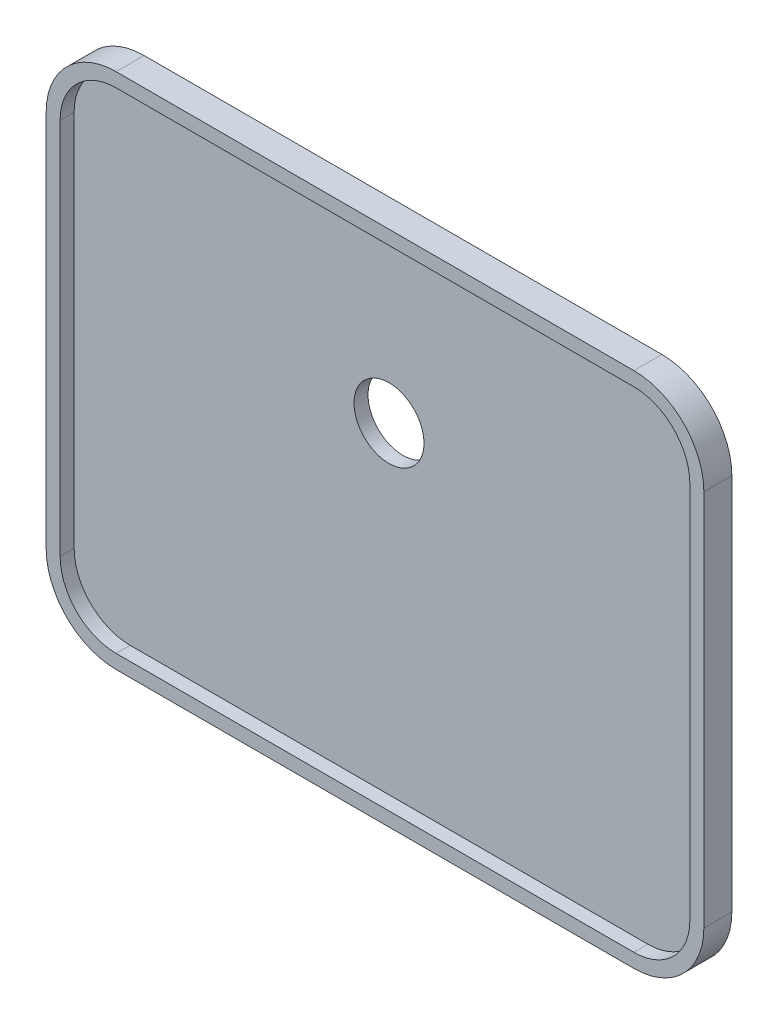
ISO-10303-21;
HEADER;
FILE_DESCRIPTION(('STEP AP214'),'2;1');
FILE_NAME('part.step','',(''),(''),'','','');
FILE_SCHEMA(('AUTOMOTIVE_DESIGN { 1 0 10303 214 1 1 1 1 }'));
ENDSEC;
DATA;
#1=APPLICATION_CONTEXT('core data for automotive mechanical design processes');
#2=APPLICATION_PROTOCOL_DEFINITION('international standard','automotive_design',2000,#1);
#3=PRODUCT_CONTEXT('',#1,'mechanical');
#4=PRODUCT('Part','Part','',(#3));
#5=PRODUCT_RELATED_PRODUCT_CATEGORY('part','',(#4));
#6=PRODUCT_DEFINITION_FORMATION('','',#4);
#7=PRODUCT_DEFINITION_CONTEXT('part definition',#1,'design');
#8=PRODUCT_DEFINITION('design','',#6,#7);
#9=PRODUCT_DEFINITION_SHAPE('','',#8);
#10=(LENGTH_UNIT() NAMED_UNIT(*) SI_UNIT(.MILLI.,.METRE.));
#11=(NAMED_UNIT(*) PLANE_ANGLE_UNIT() SI_UNIT($,.RADIAN.));
#12=(NAMED_UNIT(*) SI_UNIT($,.STERADIAN.) SOLID_ANGLE_UNIT());
#13=UNCERTAINTY_MEASURE_WITH_UNIT(LENGTH_MEASURE(1.E-05),#10,'distance_accuracy_value','');
#14=(GEOMETRIC_REPRESENTATION_CONTEXT(3) GLOBAL_UNCERTAINTY_ASSIGNED_CONTEXT((#13)) GLOBAL_UNIT_ASSIGNED_CONTEXT((#10,
#11,#12)) REPRESENTATION_CONTEXT('',''));
#15=CARTESIAN_POINT('',(0.,0.,0.));
#16=DIRECTION('',(0.,0.,1.));
#17=DIRECTION('',(1.,0.,0.));
#18=AXIS2_PLACEMENT_3D('',#15,#16,#17);
#19=CARTESIAN_POINT('',(-0.33033494899213,45.0936002495328,0.));
#20=DIRECTION('',(0.,0.,-1.));
#21=DIRECTION('',(-1.,0.,0.));
#22=AXIS2_PLACEMENT_3D('',#19,#20,#21);
#23=PLANE('',#22);
#24=CARTESIAN_POINT('',(-0.33033494899213,45.0936002495328,0.));
#25=DIRECTION('',(0.,0.,1.));
#26=DIRECTION('',(-1.,0.,0.));
#27=AXIS2_PLACEMENT_3D('',#24,#25,#26);
#28=CIRCLE('',#27,50.);
#29=CARTESIAN_POINT('',(-0.33033494899213,95.0936002495329,0.));
#30=VERTEX_POINT('',#29);
#31=CARTESIAN_POINT('',(-50.3303349489921,45.0936002495328,0.));
#32=VERTEX_POINT('',#31);
#33=EDGE_CURVE('E206',#30,#32,#28,.T.);
#34=ORIENTED_EDGE('',*,*,#33,.F.);
#35=DIRECTION('',(-1.,0.,0.));
#36=VECTOR('',#35,1.);
#37=CARTESIAN_POINT('',(-0.33033494899213,95.0936002495329,0.));
#38=LINE('',#37,#36);
#39=CARTESIAN_POINT('',(369.669665051008,95.0936002495329,0.));
#40=VERTEX_POINT('',#39);
#41=EDGE_CURVE('E211',#40,#30,#38,.T.);
#42=ORIENTED_EDGE('',*,*,#41,.F.);
#43=CARTESIAN_POINT('',(369.669665051008,45.0936002495329,0.));
#44=DIRECTION('',(0.,0.,1.));
#45=DIRECTION('',(1.,0.,0.));
#46=AXIS2_PLACEMENT_3D('',#43,#44,#45);
#47=CIRCLE('',#46,50.);
#48=CARTESIAN_POINT('',(419.669665051008,45.0936002495329,0.));
#49=VERTEX_POINT('',#48);
#50=EDGE_CURVE('E238',#49,#40,#47,.T.);
#51=ORIENTED_EDGE('',*,*,#50,.F.);
#52=DIRECTION('',(0.,1.,0.));
#53=VECTOR('',#52,1.);
#54=CARTESIAN_POINT('',(419.669665051008,45.0936002495329,0.));
#55=LINE('',#54,#53);
#56=CARTESIAN_POINT('',(419.669665051008,-224.906399750467,0.));
#57=VERTEX_POINT('',#56);
#58=EDGE_CURVE('E236',#57,#49,#55,.T.);
#59=ORIENTED_EDGE('',*,*,#58,.F.);
#60=CARTESIAN_POINT('',(369.669665051008,-224.906399750467,0.));
#61=DIRECTION('',(0.,0.,1.));
#62=DIRECTION('',(1.,0.,0.));
#63=AXIS2_PLACEMENT_3D('',#60,#61,#62);
#64=CIRCLE('',#63,50.);
#65=CARTESIAN_POINT('',(369.669665051008,-274.906399750467,0.));
#66=VERTEX_POINT('',#65);
#67=EDGE_CURVE('E234',#66,#57,#64,.T.);
#68=ORIENTED_EDGE('',*,*,#67,.F.);
#69=DIRECTION('',(1.,0.,0.));
#70=VECTOR('',#69,1.);
#71=CARTESIAN_POINT('',(-0.330334948992123,-274.906399750467,0.));
#72=LINE('',#71,#70);
#73=CARTESIAN_POINT('',(-0.330334948992123,-274.906399750467,0.));
#74=VERTEX_POINT('',#73);
#75=EDGE_CURVE('E232',#74,#66,#72,.T.);
#76=ORIENTED_EDGE('',*,*,#75,.F.);
#77=CARTESIAN_POINT('',(-0.330334948992123,-224.906399750467,0.));
#78=DIRECTION('',(0.,0.,1.));
#79=DIRECTION('',(1.,0.,0.));
#80=AXIS2_PLACEMENT_3D('',#77,#78,#79);
#81=CIRCLE('',#80,50.);
#82=CARTESIAN_POINT('',(-50.3303349489921,-224.906399750467,0.));
#83=VERTEX_POINT('',#82);
#84=EDGE_CURVE('E230',#83,#74,#81,.T.);
#85=ORIENTED_EDGE('',*,*,#84,.F.);
#86=DIRECTION('',(0.,-1.,0.));
#87=VECTOR('',#86,1.);
#88=CARTESIAN_POINT('',(-50.3303349489921,45.0936002495328,0.));
#89=LINE('',#88,#87);
#90=EDGE_CURVE('E228',#32,#83,#89,.T.);
#91=ORIENTED_EDGE('',*,*,#90,.F.);
#92=EDGE_LOOP('',(#34,#42,#51,#59,#68,#76,#85,#91));
#93=FACE_BOUND('',#92,.T.);
#94=CARTESIAN_POINT('',(184.669665051008,-34.9063997504672,0.));
#95=DIRECTION('',(0.,0.,1.));
#96=DIRECTION('',(1.,0.,0.));
#97=AXIS2_PLACEMENT_3D('',#94,#95,#96);
#98=CIRCLE('',#97,25.);
#99=CARTESIAN_POINT('',(209.669665051008,-34.9063997504672,0.));
#100=VERTEX_POINT('',#99);
#101=EDGE_CURVE('E359',#100,#100,#98,.T.);
#102=ORIENTED_EDGE('',*,*,#101,.T.);
#103=EDGE_LOOP('',(#102));
#104=FACE_BOUND('',#103,.T.);
#105=ADVANCED_FACE('F31',(#93,#104),#23,.T.);
#106=CARTESIAN_POINT('',(-0.330334948992123,-224.906399750467,10.));
#107=DIRECTION('',(0.,0.,1.));
#108=DIRECTION('',(1.,0.,0.));
#109=AXIS2_PLACEMENT_3D('',#106,#107,#108);
#110=PLANE('',#109);
#111=CARTESIAN_POINT('',(-0.330334948992123,-224.906399750467,10.));
#112=DIRECTION('',(0.,0.,1.));
#113=DIRECTION('',(1.,0.,0.));
#114=AXIS2_PLACEMENT_3D('',#111,#112,#113);
#115=CIRCLE('',#114,40.);
#116=CARTESIAN_POINT('',(-40.3303349489921,-224.906399750467,10.));
#117=VERTEX_POINT('',#116);
#118=CARTESIAN_POINT('',(-0.330334948992123,-264.906399750467,10.));
#119=VERTEX_POINT('',#118);
#120=EDGE_CURVE('E160',#117,#119,#115,.T.);
#121=ORIENTED_EDGE('',*,*,#120,.T.);
#122=DIRECTION('',(1.,0.,0.));
#123=VECTOR('',#122,1.);
#124=CARTESIAN_POINT('',(-0.330334948991838,-264.906399750467,10.));
#125=LINE('',#124,#123);
#126=CARTESIAN_POINT('',(369.669665051008,-264.906399750467,10.));
#127=VERTEX_POINT('',#126);
#128=EDGE_CURVE('E47',#119,#127,#125,.T.);
#129=ORIENTED_EDGE('',*,*,#128,.T.);
#130=CARTESIAN_POINT('',(369.669665051008,-224.906399750467,10.));
#131=DIRECTION('',(0.,0.,1.));
#132=DIRECTION('',(-1.,0.,0.));
#133=AXIS2_PLACEMENT_3D('',#130,#131,#132);
#134=CIRCLE('',#133,40.);
#135=CARTESIAN_POINT('',(409.669665051008,-224.906399750467,10.));
#136=VERTEX_POINT('',#135);
#137=EDGE_CURVE('E55',#127,#136,#134,.T.);
#138=ORIENTED_EDGE('',*,*,#137,.T.);
#139=DIRECTION('',(0.,1.,0.));
#140=VECTOR('',#139,1.);
#141=CARTESIAN_POINT('',(409.669665051008,-224.906399750467,10.));
#142=LINE('',#141,#140);
#143=CARTESIAN_POINT('',(409.669665051008,45.0936002495329,10.));
#144=VERTEX_POINT('',#143);
#145=EDGE_CURVE('E364',#136,#144,#142,.T.);
#146=ORIENTED_EDGE('',*,*,#145,.T.);
#147=CARTESIAN_POINT('',(369.669665051008,45.0936002495329,10.));
#148=DIRECTION('',(0.,0.,1.));
#149=DIRECTION('',(1.,0.,0.));
#150=AXIS2_PLACEMENT_3D('',#147,#148,#149);
#151=CIRCLE('',#150,40.);
#152=CARTESIAN_POINT('',(369.669665051008,85.0936002495329,10.));
#153=VERTEX_POINT('',#152);
#154=EDGE_CURVE('E367',#144,#153,#151,.T.);
#155=ORIENTED_EDGE('',*,*,#154,.T.);
#156=DIRECTION('',(-1.,0.,0.));
#157=VECTOR('',#156,1.);
#158=CARTESIAN_POINT('',(-0.330334948991845,85.0936002495329,10.));
#159=LINE('',#158,#157);
#160=CARTESIAN_POINT('',(-0.330334948992132,85.0936002495329,10.));
#161=VERTEX_POINT('',#160);
#162=EDGE_CURVE('E174',#153,#161,#159,.T.);
#163=ORIENTED_EDGE('',*,*,#162,.T.);
#164=CARTESIAN_POINT('',(-0.330334948992123,45.0936002495328,10.));
#165=DIRECTION('',(0.,0.,1.));
#166=DIRECTION('',(1.,0.,0.));
#167=AXIS2_PLACEMENT_3D('',#164,#165,#166);
#168=CIRCLE('',#167,40.);
#169=CARTESIAN_POINT('',(-40.3303349489921,45.0936002495328,10.));
#170=VERTEX_POINT('',#169);
#171=EDGE_CURVE('E169',#161,#170,#168,.T.);
#172=ORIENTED_EDGE('',*,*,#171,.T.);
#173=DIRECTION('',(0.,-1.,0.));
#174=VECTOR('',#173,1.);
#175=CARTESIAN_POINT('',(-40.3303349489921,-224.906399750467,10.));
#176=LINE('',#175,#174);
#177=EDGE_CURVE('E151',#170,#117,#176,.T.);
#178=ORIENTED_EDGE('',*,*,#177,.T.);
#179=EDGE_LOOP('',(#121,#129,#138,#146,#155,#163,#172,#178));
#180=FACE_BOUND('',#179,.T.);
#181=CARTESIAN_POINT('',(184.669665051008,-34.9063997504672,10.));
#182=DIRECTION('',(0.,0.,1.));
#183=DIRECTION('',(1.,0.,0.));
#184=AXIS2_PLACEMENT_3D('',#181,#182,#183);
#185=CIRCLE('',#184,25.);
#186=CARTESIAN_POINT('',(209.669665051008,-34.9063997504672,10.));
#187=VERTEX_POINT('',#186);
#188=EDGE_CURVE('E35',#187,#187,#185,.F.);
#189=ORIENTED_EDGE('',*,*,#188,.T.);
#190=EDGE_LOOP('',(#189));
#191=FACE_BOUND('',#190,.T.);
#192=ADVANCED_FACE('F166',(#180,#191),#110,.T.);
#193=CARTESIAN_POINT('',(-0.33033494899213,45.0936002495328,20.));
#194=DIRECTION('',(0.,0.,-1.));
#195=DIRECTION('',(-1.,0.,0.));
#196=AXIS2_PLACEMENT_3D('',#193,#194,#195);
#197=PLANE('',#196);
#198=CARTESIAN_POINT('',(-0.33033494899213,45.0936002495328,20.));
#199=DIRECTION('',(0.,0.,1.));
#200=DIRECTION('',(-1.,0.,0.));
#201=AXIS2_PLACEMENT_3D('',#198,#199,#200);
#202=CIRCLE('',#201,50.);
#203=CARTESIAN_POINT('',(-0.33033494899213,95.0936002495329,20.));
#204=VERTEX_POINT('',#203);
#205=CARTESIAN_POINT('',(-50.3303349489921,45.0936002495328,20.));
#206=VERTEX_POINT('',#205);
#207=EDGE_CURVE('E207',#204,#206,#202,.T.);
#208=ORIENTED_EDGE('',*,*,#207,.T.);
#209=DIRECTION('',(0.,-1.,0.));
#210=VECTOR('',#209,1.);
#211=CARTESIAN_POINT('',(-50.3303349489921,45.0936002495328,20.));
#212=LINE('',#211,#210);
#213=CARTESIAN_POINT('',(-50.3303349489921,-224.906399750467,20.));
#214=VERTEX_POINT('',#213);
#215=EDGE_CURVE('E210',#206,#214,#212,.T.);
#216=ORIENTED_EDGE('',*,*,#215,.T.);
#217=CARTESIAN_POINT('',(-0.330334948992123,-224.906399750467,20.));
#218=DIRECTION('',(0.,0.,1.));
#219=DIRECTION('',(1.,0.,0.));
#220=AXIS2_PLACEMENT_3D('',#217,#218,#219);
#221=CIRCLE('',#220,50.);
#222=CARTESIAN_POINT('',(-0.330334948992123,-274.906399750467,20.));
#223=VERTEX_POINT('',#222);
#224=EDGE_CURVE('E213',#214,#223,#221,.T.);
#225=ORIENTED_EDGE('',*,*,#224,.T.);
#226=DIRECTION('',(1.,0.,0.));
#227=VECTOR('',#226,1.);
#228=CARTESIAN_POINT('',(-0.330334948992123,-274.906399750467,20.));
#229=LINE('',#228,#227);
#230=CARTESIAN_POINT('',(369.669665051008,-274.906399750467,20.));
#231=VERTEX_POINT('',#230);
#232=EDGE_CURVE('E215',#223,#231,#229,.T.);
#233=ORIENTED_EDGE('',*,*,#232,.T.);
#234=CARTESIAN_POINT('',(369.669665051008,-224.906399750467,20.));
#235=DIRECTION('',(0.,0.,1.));
#236=DIRECTION('',(1.,0.,0.));
#237=AXIS2_PLACEMENT_3D('',#234,#235,#236);
#238=CIRCLE('',#237,50.);
#239=CARTESIAN_POINT('',(419.669665051008,-224.906399750467,20.));
#240=VERTEX_POINT('',#239);
#241=EDGE_CURVE('E217',#231,#240,#238,.T.);
#242=ORIENTED_EDGE('',*,*,#241,.T.);
#243=DIRECTION('',(0.,1.,0.));
#244=VECTOR('',#243,1.);
#245=CARTESIAN_POINT('',(419.669665051008,45.0936002495329,20.));
#246=LINE('',#245,#244);
#247=CARTESIAN_POINT('',(419.669665051008,45.0936002495329,20.));
#248=VERTEX_POINT('',#247);
#249=EDGE_CURVE('E219',#240,#248,#246,.T.);
#250=ORIENTED_EDGE('',*,*,#249,.T.);
#251=CARTESIAN_POINT('',(369.669665051008,45.0936002495329,20.));
#252=DIRECTION('',(0.,0.,1.));
#253=DIRECTION('',(1.,0.,0.));
#254=AXIS2_PLACEMENT_3D('',#251,#252,#253);
#255=CIRCLE('',#254,50.);
#256=CARTESIAN_POINT('',(369.669665051008,95.0936002495329,20.));
#257=VERTEX_POINT('',#256);
#258=EDGE_CURVE('E221',#248,#257,#255,.T.);
#259=ORIENTED_EDGE('',*,*,#258,.T.);
#260=DIRECTION('',(-1.,0.,0.));
#261=VECTOR('',#260,1.);
#262=CARTESIAN_POINT('',(-0.33033494899213,95.0936002495329,20.));
#263=LINE('',#262,#261);
#264=EDGE_CURVE('E223',#257,#204,#263,.T.);
#265=ORIENTED_EDGE('',*,*,#264,.T.);
#266=EDGE_LOOP('',(#208,#216,#225,#233,#242,#250,#259,#265));
#267=FACE_BOUND('',#266,.T.);
#268=CARTESIAN_POINT('',(-0.330334948992123,-224.906399750467,20.));
#269=DIRECTION('',(0.,0.,1.));
#270=DIRECTION('',(1.,0.,0.));
#271=AXIS2_PLACEMENT_3D('',#268,#269,#270);
#272=CIRCLE('',#271,40.);
#273=CARTESIAN_POINT('',(-40.3303349489921,-224.906399750467,20.));
#274=VERTEX_POINT('',#273);
#275=CARTESIAN_POINT('',(-0.330334948992123,-264.906399750467,20.));
#276=VERTEX_POINT('',#275);
#277=EDGE_CURVE('E170',#274,#276,#272,.T.);
#278=ORIENTED_EDGE('',*,*,#277,.F.);
#279=DIRECTION('',(0.,-1.,0.));
#280=VECTOR('',#279,1.);
#281=CARTESIAN_POINT('',(-40.3303349489921,45.0936002495328,20.));
#282=LINE('',#281,#280);
#283=CARTESIAN_POINT('',(-40.3303349489921,45.0936002495328,20.));
#284=VERTEX_POINT('',#283);
#285=EDGE_CURVE('E154',#284,#274,#282,.T.);
#286=ORIENTED_EDGE('',*,*,#285,.F.);
#287=CARTESIAN_POINT('',(-0.33033494899213,45.0936002495328,20.));
#288=DIRECTION('',(0.,0.,1.));
#289=DIRECTION('',(-1.,0.,0.));
#290=AXIS2_PLACEMENT_3D('',#287,#288,#289);
#291=CIRCLE('',#290,40.);
#292=CARTESIAN_POINT('',(-0.330334948992132,85.0936002495329,20.));
#293=VERTEX_POINT('',#292);
#294=EDGE_CURVE('E187',#293,#284,#291,.T.);
#295=ORIENTED_EDGE('',*,*,#294,.F.);
#296=DIRECTION('',(-1.,0.,0.));
#297=VECTOR('',#296,1.);
#298=CARTESIAN_POINT('',(-0.33033494899213,85.0936002495329,20.));
#299=LINE('',#298,#297);
#300=CARTESIAN_POINT('',(369.669665051008,85.0936002495329,20.));
#301=VERTEX_POINT('',#300);
#302=EDGE_CURVE('E185',#301,#293,#299,.T.);
#303=ORIENTED_EDGE('',*,*,#302,.F.);
#304=CARTESIAN_POINT('',(369.669665051008,45.0936002495329,20.));
#305=DIRECTION('',(0.,0.,1.));
#306=DIRECTION('',(1.,0.,0.));
#307=AXIS2_PLACEMENT_3D('',#304,#305,#306);
#308=CIRCLE('',#307,40.);
#309=CARTESIAN_POINT('',(409.669665051008,45.0936002495329,20.));
#310=VERTEX_POINT('',#309);
#311=EDGE_CURVE('E183',#310,#301,#308,.T.);
#312=ORIENTED_EDGE('',*,*,#311,.F.);
#313=DIRECTION('',(0.,1.,0.));
#314=VECTOR('',#313,1.);
#315=CARTESIAN_POINT('',(409.669665051008,45.0936002495329,20.));
#316=LINE('',#315,#314);
#317=CARTESIAN_POINT('',(409.669665051008,-224.906399750467,20.));
#318=VERTEX_POINT('',#317);
#319=EDGE_CURVE('E181',#318,#310,#316,.T.);
#320=ORIENTED_EDGE('',*,*,#319,.F.);
#321=CARTESIAN_POINT('',(369.669665051008,-224.906399750467,20.));
#322=DIRECTION('',(0.,0.,1.));
#323=DIRECTION('',(1.,0.,0.));
#324=AXIS2_PLACEMENT_3D('',#321,#322,#323);
#325=CIRCLE('',#324,40.);
#326=CARTESIAN_POINT('',(369.669665051008,-264.906399750467,20.));
#327=VERTEX_POINT('',#326);
#328=EDGE_CURVE('E179',#327,#318,#325,.T.);
#329=ORIENTED_EDGE('',*,*,#328,.F.);
#330=DIRECTION('',(1.,0.,0.));
#331=VECTOR('',#330,1.);
#332=CARTESIAN_POINT('',(-0.330334948992123,-264.906399750467,20.));
#333=LINE('',#332,#331);
#334=EDGE_CURVE('E172',#276,#327,#333,.T.);
#335=ORIENTED_EDGE('',*,*,#334,.F.);
#336=EDGE_LOOP('',(#278,#286,#295,#303,#312,#320,#329,#335));
#337=FACE_BOUND('',#336,.T.);
#338=ADVANCED_FACE('F282',(#267,#337),#197,.F.);
#339=CARTESIAN_POINT('',(-0.33033494899213,45.0936002495328,20.));
#340=DIRECTION('',(0.,0.,-1.));
#341=DIRECTION('',(-1.,0.,0.));
#342=AXIS2_PLACEMENT_3D('',#339,#340,#341);
#343=CYLINDRICAL_SURFACE('',#342,50.);
#344=ORIENTED_EDGE('',*,*,#33,.T.);
#345=DIRECTION('',(0.,0.,-1.));
#346=VECTOR('',#345,1.);
#347=CARTESIAN_POINT('',(-50.3303349489921,45.0936002495328,20.));
#348=LINE('',#347,#346);
#349=EDGE_CURVE('E11',#206,#32,#348,.T.);
#350=ORIENTED_EDGE('',*,*,#349,.F.);
#351=ORIENTED_EDGE('',*,*,#207,.F.);
#352=DIRECTION('',(0.,0.,-1.));
#353=VECTOR('',#352,1.);
#354=CARTESIAN_POINT('',(-0.33033494899213,95.0936002495329,20.));
#355=LINE('',#354,#353);
#356=EDGE_CURVE('E225',#204,#30,#355,.T.);
#357=ORIENTED_EDGE('',*,*,#356,.T.);
#358=EDGE_LOOP('',(#344,#350,#351,#357));
#359=FACE_BOUND('',#358,.T.);
#360=ADVANCED_FACE('F33',(#359),#343,.T.);
#361=CARTESIAN_POINT('',(-50.3303349489921,45.0936002495328,20.));
#362=DIRECTION('',(1.,0.,0.));
#363=DIRECTION('',(0.,0.,-1.));
#364=AXIS2_PLACEMENT_3D('',#361,#362,#363);
#365=PLANE('',#364);
#366=ORIENTED_EDGE('',*,*,#90,.T.);
#367=DIRECTION('',(0.,0.,-1.));
#368=VECTOR('',#367,1.);
#369=CARTESIAN_POINT('',(-50.3303349489921,-224.906399750467,20.));
#370=LINE('',#369,#368);
#371=EDGE_CURVE('E40',#214,#83,#370,.T.);
#372=ORIENTED_EDGE('',*,*,#371,.F.);
#373=ORIENTED_EDGE('',*,*,#215,.F.);
#374=ORIENTED_EDGE('',*,*,#349,.T.);
#375=EDGE_LOOP('',(#366,#372,#373,#374));
#376=FACE_BOUND('',#375,.T.);
#377=ADVANCED_FACE('F287',(#376),#365,.F.);
#378=CARTESIAN_POINT('',(-0.330334948992123,-224.906399750467,20.));
#379=DIRECTION('',(0.,0.,-1.));
#380=DIRECTION('',(-1.,0.,0.));
#381=AXIS2_PLACEMENT_3D('',#378,#379,#380);
#382=CYLINDRICAL_SURFACE('',#381,50.);
#383=ORIENTED_EDGE('',*,*,#84,.T.);
#384=DIRECTION('',(0.,0.,-1.));
#385=VECTOR('',#384,1.);
#386=CARTESIAN_POINT('',(-0.330334948992123,-274.906399750467,20.));
#387=LINE('',#386,#385);
#388=EDGE_CURVE('E255',#223,#74,#387,.T.);
#389=ORIENTED_EDGE('',*,*,#388,.F.);
#390=ORIENTED_EDGE('',*,*,#224,.F.);
#391=ORIENTED_EDGE('',*,*,#371,.T.);
#392=EDGE_LOOP('',(#383,#389,#390,#391));
#393=FACE_BOUND('',#392,.T.);
#394=ADVANCED_FACE('F263',(#393),#382,.T.);
#395=CARTESIAN_POINT('',(-0.330334948992123,-274.906399750467,20.));
#396=DIRECTION('',(0.,1.,0.));
#397=DIRECTION('',(-1.,0.,0.));
#398=AXIS2_PLACEMENT_3D('',#395,#396,#397);
#399=PLANE('',#398);
#400=ORIENTED_EDGE('',*,*,#75,.T.);
#401=DIRECTION('',(0.,0.,-1.));
#402=VECTOR('',#401,1.);
#403=CARTESIAN_POINT('',(369.669665051008,-274.906399750467,20.));
#404=LINE('',#403,#402);
#405=EDGE_CURVE('E252',#231,#66,#404,.T.);
#406=ORIENTED_EDGE('',*,*,#405,.F.);
#407=ORIENTED_EDGE('',*,*,#232,.F.);
#408=ORIENTED_EDGE('',*,*,#388,.T.);
#409=EDGE_LOOP('',(#400,#406,#407,#408));
#410=FACE_BOUND('',#409,.T.);
#411=ADVANCED_FACE('F274',(#410),#399,.F.);
#412=CARTESIAN_POINT('',(369.669665051008,-224.906399750467,20.));
#413=DIRECTION('',(0.,0.,-1.));
#414=DIRECTION('',(-1.,0.,0.));
#415=AXIS2_PLACEMENT_3D('',#412,#413,#414);
#416=CYLINDRICAL_SURFACE('',#415,50.);
#417=ORIENTED_EDGE('',*,*,#67,.T.);
#418=DIRECTION('',(0.,0.,-1.));
#419=VECTOR('',#418,1.);
#420=CARTESIAN_POINT('',(419.669665051008,-224.906399750467,20.));
#421=LINE('',#420,#419);
#422=EDGE_CURVE('E249',#240,#57,#421,.T.);
#423=ORIENTED_EDGE('',*,*,#422,.F.);
#424=ORIENTED_EDGE('',*,*,#241,.F.);
#425=ORIENTED_EDGE('',*,*,#405,.T.);
#426=EDGE_LOOP('',(#417,#423,#424,#425));
#427=FACE_BOUND('',#426,.T.);
#428=ADVANCED_FACE('F278',(#427),#416,.T.);
#429=CARTESIAN_POINT('',(419.669665051008,45.0936002495329,20.));
#430=DIRECTION('',(-1.,0.,0.));
#431=DIRECTION('',(0.,0.,1.));
#432=AXIS2_PLACEMENT_3D('',#429,#430,#431);
#433=PLANE('',#432);
#434=ORIENTED_EDGE('',*,*,#58,.T.);
#435=DIRECTION('',(0.,0.,-1.));
#436=VECTOR('',#435,1.);
#437=CARTESIAN_POINT('',(419.669665051008,45.0936002495329,20.));
#438=LINE('',#437,#436);
#439=EDGE_CURVE('E246',#248,#49,#438,.T.);
#440=ORIENTED_EDGE('',*,*,#439,.F.);
#441=ORIENTED_EDGE('',*,*,#249,.F.);
#442=ORIENTED_EDGE('',*,*,#422,.T.);
#443=EDGE_LOOP('',(#434,#440,#441,#442));
#444=FACE_BOUND('',#443,.T.);
#445=ADVANCED_FACE('F300',(#444),#433,.F.);
#446=CARTESIAN_POINT('',(369.669665051008,45.0936002495329,20.));
#447=DIRECTION('',(0.,0.,-1.));
#448=DIRECTION('',(-1.,0.,0.));
#449=AXIS2_PLACEMENT_3D('',#446,#447,#448);
#450=CYLINDRICAL_SURFACE('',#449,50.);
#451=ORIENTED_EDGE('',*,*,#50,.T.);
#452=DIRECTION('',(0.,0.,-1.));
#453=VECTOR('',#452,1.);
#454=CARTESIAN_POINT('',(369.669665051008,95.0936002495329,20.));
#455=LINE('',#454,#453);
#456=EDGE_CURVE('E243',#257,#40,#455,.T.);
#457=ORIENTED_EDGE('',*,*,#456,.F.);
#458=ORIENTED_EDGE('',*,*,#258,.F.);
#459=ORIENTED_EDGE('',*,*,#439,.T.);
#460=EDGE_LOOP('',(#451,#457,#458,#459));
#461=FACE_BOUND('',#460,.T.);
#462=ADVANCED_FACE('F298',(#461),#450,.T.);
#463=CARTESIAN_POINT('',(-0.33033494899213,95.0936002495329,20.));
#464=DIRECTION('',(0.,-1.,0.));
#465=DIRECTION('',(0.,0.,-1.));
#466=AXIS2_PLACEMENT_3D('',#463,#464,#465);
#467=PLANE('',#466);
#468=ORIENTED_EDGE('',*,*,#41,.T.);
#469=ORIENTED_EDGE('',*,*,#356,.F.);
#470=ORIENTED_EDGE('',*,*,#264,.F.);
#471=ORIENTED_EDGE('',*,*,#456,.T.);
#472=EDGE_LOOP('',(#468,#469,#470,#471));
#473=FACE_BOUND('',#472,.T.);
#474=ADVANCED_FACE('F293',(#473),#467,.F.);
#475=CARTESIAN_POINT('',(-0.330334948992123,-224.906399750467,20.));
#476=DIRECTION('',(0.,0.,-1.));
#477=DIRECTION('',(-1.,0.,0.));
#478=AXIS2_PLACEMENT_3D('',#475,#476,#477);
#479=CYLINDRICAL_SURFACE('',#478,40.);
#480=ORIENTED_EDGE('',*,*,#120,.F.);
#481=DIRECTION('',(0.,0.,-1.));
#482=VECTOR('',#481,1.);
#483=CARTESIAN_POINT('',(-40.3303349489921,-224.906399750467,20.));
#484=LINE('',#483,#482);
#485=EDGE_CURVE('E147',#274,#117,#484,.T.);
#486=ORIENTED_EDGE('',*,*,#485,.F.);
#487=ORIENTED_EDGE('',*,*,#277,.T.);
#488=DIRECTION('',(0.,0.,-1.));
#489=VECTOR('',#488,1.);
#490=CARTESIAN_POINT('',(-0.330334948992123,-264.906399750467,20.));
#491=LINE('',#490,#489);
#492=EDGE_CURVE('E162',#276,#119,#491,.T.);
#493=ORIENTED_EDGE('',*,*,#492,.T.);
#494=EDGE_LOOP('',(#480,#486,#487,#493));
#495=FACE_BOUND('',#494,.T.);
#496=ADVANCED_FACE('F161',(#495),#479,.F.);
#497=CARTESIAN_POINT('',(-0.330334948992123,-264.906399750467,20.));
#498=DIRECTION('',(0.,1.,0.));
#499=DIRECTION('',(0.,0.,1.));
#500=AXIS2_PLACEMENT_3D('',#497,#498,#499);
#501=PLANE('',#500);
#502=ORIENTED_EDGE('',*,*,#128,.F.);
#503=ORIENTED_EDGE('',*,*,#492,.F.);
#504=ORIENTED_EDGE('',*,*,#334,.T.);
#505=DIRECTION('',(0.,0.,-1.));
#506=VECTOR('',#505,1.);
#507=CARTESIAN_POINT('',(369.669665051008,-264.906399750467,20.));
#508=LINE('',#507,#506);
#509=EDGE_CURVE('E203',#327,#127,#508,.T.);
#510=ORIENTED_EDGE('',*,*,#509,.T.);
#511=EDGE_LOOP('',(#502,#503,#504,#510));
#512=FACE_BOUND('',#511,.T.);
#513=ADVANCED_FACE('F322',(#512),#501,.T.);
#514=CARTESIAN_POINT('',(369.669665051008,-224.906399750467,20.));
#515=DIRECTION('',(0.,0.,-1.));
#516=DIRECTION('',(-1.,0.,0.));
#517=AXIS2_PLACEMENT_3D('',#514,#515,#516);
#518=CYLINDRICAL_SURFACE('',#517,40.);
#519=ORIENTED_EDGE('',*,*,#137,.F.);
#520=ORIENTED_EDGE('',*,*,#509,.F.);
#521=ORIENTED_EDGE('',*,*,#328,.T.);
#522=DIRECTION('',(0.,0.,-1.));
#523=VECTOR('',#522,1.);
#524=CARTESIAN_POINT('',(409.669665051008,-224.906399750467,20.));
#525=LINE('',#524,#523);
#526=EDGE_CURVE('E201',#318,#136,#525,.T.);
#527=ORIENTED_EDGE('',*,*,#526,.T.);
#528=EDGE_LOOP('',(#519,#520,#521,#527));
#529=FACE_BOUND('',#528,.T.);
#530=ADVANCED_FACE('F326',(#529),#518,.F.);
#531=CARTESIAN_POINT('',(409.669665051008,45.0936002495329,20.));
#532=DIRECTION('',(-1.,0.,0.));
#533=DIRECTION('',(0.,-1.,0.));
#534=AXIS2_PLACEMENT_3D('',#531,#532,#533);
#535=PLANE('',#534);
#536=ORIENTED_EDGE('',*,*,#145,.F.);
#537=ORIENTED_EDGE('',*,*,#526,.F.);
#538=ORIENTED_EDGE('',*,*,#319,.T.);
#539=DIRECTION('',(0.,0.,-1.));
#540=VECTOR('',#539,1.);
#541=CARTESIAN_POINT('',(409.669665051008,45.0936002495329,20.));
#542=LINE('',#541,#540);
#543=EDGE_CURVE('E198',#310,#144,#542,.T.);
#544=ORIENTED_EDGE('',*,*,#543,.T.);
#545=EDGE_LOOP('',(#536,#537,#538,#544));
#546=FACE_BOUND('',#545,.T.);
#547=ADVANCED_FACE('F331',(#546),#535,.T.);
#548=CARTESIAN_POINT('',(369.669665051008,45.0936002495329,20.));
#549=DIRECTION('',(0.,0.,-1.));
#550=DIRECTION('',(-1.,0.,0.));
#551=AXIS2_PLACEMENT_3D('',#548,#549,#550);
#552=CYLINDRICAL_SURFACE('',#551,40.);
#553=ORIENTED_EDGE('',*,*,#154,.F.);
#554=ORIENTED_EDGE('',*,*,#543,.F.);
#555=ORIENTED_EDGE('',*,*,#311,.T.);
#556=DIRECTION('',(0.,0.,-1.));
#557=VECTOR('',#556,1.);
#558=CARTESIAN_POINT('',(369.669665051008,85.0936002495329,20.));
#559=LINE('',#558,#557);
#560=EDGE_CURVE('E195',#301,#153,#559,.T.);
#561=ORIENTED_EDGE('',*,*,#560,.T.);
#562=EDGE_LOOP('',(#553,#554,#555,#561));
#563=FACE_BOUND('',#562,.T.);
#564=ADVANCED_FACE('F334',(#563),#552,.F.);
#565=CARTESIAN_POINT('',(-0.33033494899213,85.0936002495329,20.));
#566=DIRECTION('',(0.,-1.,0.));
#567=DIRECTION('',(0.,0.,-1.));
#568=AXIS2_PLACEMENT_3D('',#565,#566,#567);
#569=PLANE('',#568);
#570=ORIENTED_EDGE('',*,*,#162,.F.);
#571=ORIENTED_EDGE('',*,*,#560,.F.);
#572=ORIENTED_EDGE('',*,*,#302,.T.);
#573=DIRECTION('',(0.,0.,-1.));
#574=VECTOR('',#573,1.);
#575=CARTESIAN_POINT('',(-0.330334948992132,85.0936002495329,20.));
#576=LINE('',#575,#574);
#577=EDGE_CURVE('E192',#293,#161,#576,.T.);
#578=ORIENTED_EDGE('',*,*,#577,.T.);
#579=EDGE_LOOP('',(#570,#571,#572,#578));
#580=FACE_BOUND('',#579,.T.);
#581=ADVANCED_FACE('F338',(#580),#569,.T.);
#582=CARTESIAN_POINT('',(-0.33033494899213,45.0936002495328,20.));
#583=DIRECTION('',(0.,0.,-1.));
#584=DIRECTION('',(-1.,0.,0.));
#585=AXIS2_PLACEMENT_3D('',#582,#583,#584);
#586=CYLINDRICAL_SURFACE('',#585,40.);
#587=ORIENTED_EDGE('',*,*,#171,.F.);
#588=ORIENTED_EDGE('',*,*,#577,.F.);
#589=ORIENTED_EDGE('',*,*,#294,.T.);
#590=DIRECTION('',(0.,0.,-1.));
#591=VECTOR('',#590,1.);
#592=CARTESIAN_POINT('',(-40.3303349489921,45.0936002495328,20.));
#593=LINE('',#592,#591);
#594=EDGE_CURVE('E157',#284,#170,#593,.T.);
#595=ORIENTED_EDGE('',*,*,#594,.T.);
#596=EDGE_LOOP('',(#587,#588,#589,#595));
#597=FACE_BOUND('',#596,.T.);
#598=ADVANCED_FACE('F342',(#597),#586,.F.);
#599=CARTESIAN_POINT('',(-40.3303349489921,45.0936002495328,20.));
#600=DIRECTION('',(1.,0.,0.));
#601=DIRECTION('',(0.,1.,0.));
#602=AXIS2_PLACEMENT_3D('',#599,#600,#601);
#603=PLANE('',#602);
#604=ORIENTED_EDGE('',*,*,#177,.F.);
#605=ORIENTED_EDGE('',*,*,#594,.F.);
#606=ORIENTED_EDGE('',*,*,#285,.T.);
#607=ORIENTED_EDGE('',*,*,#485,.T.);
#608=EDGE_LOOP('',(#604,#605,#606,#607));
#609=FACE_BOUND('',#608,.T.);
#610=ADVANCED_FACE('F149',(#609),#603,.T.);
#611=CARTESIAN_POINT('',(184.669665051008,-34.9063997504672,15.));
#612=DIRECTION('',(0.,0.,-1.));
#613=DIRECTION('',(-1.,0.,0.));
#614=AXIS2_PLACEMENT_3D('',#611,#612,#613);
#615=CYLINDRICAL_SURFACE('',#614,25.);
#616=ORIENTED_EDGE('',*,*,#188,.F.);
#617=EDGE_LOOP('',(#616));
#618=FACE_BOUND('',#617,.T.);
#619=ORIENTED_EDGE('',*,*,#101,.F.);
#620=EDGE_LOOP('',(#619));
#621=FACE_BOUND('',#620,.T.);
#622=ADVANCED_FACE('F348',(#618,#621),#615,.F.);
#623=CLOSED_SHELL('',(#105,#192,#338,#360,#377,#394,#411,#428,#445,#462,#474,#496,#513,#530,
#547,#564,#581,#598,#610,#622));
#624=MANIFOLD_SOLID_BREP('B2',#623);
#625=ADVANCED_BREP_SHAPE_REPRESENTATION('',(#18,#624),#14);
#626=SHAPE_DEFINITION_REPRESENTATION(#9,#625);
ENDSEC;
END-ISO-10303-21;
